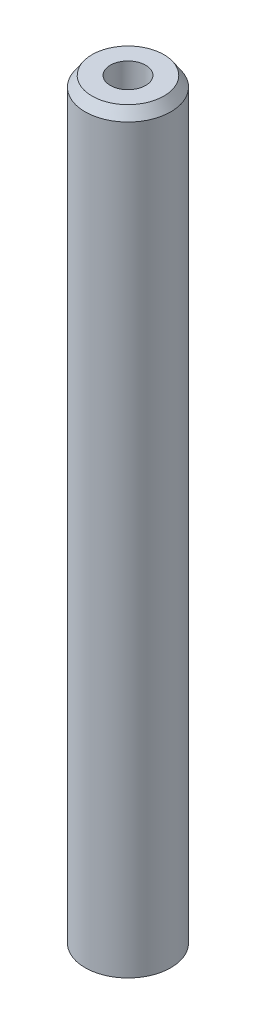
ISO-10303-21;
HEADER;
FILE_DESCRIPTION(('STEP AP214'),'2;1');
FILE_NAME('part.step','',(''),(''),'','','');
FILE_SCHEMA(('AUTOMOTIVE_DESIGN { 1 0 10303 214 1 1 1 1 }'));
ENDSEC;
DATA;
#1=APPLICATION_CONTEXT('core data for automotive mechanical design processes');
#2=APPLICATION_PROTOCOL_DEFINITION('international standard','automotive_design',2000,#1);
#3=PRODUCT_CONTEXT('',#1,'mechanical');
#4=PRODUCT('Part','Part','',(#3));
#5=PRODUCT_RELATED_PRODUCT_CATEGORY('part','',(#4));
#6=PRODUCT_DEFINITION_FORMATION('','',#4);
#7=PRODUCT_DEFINITION_CONTEXT('part definition',#1,'design');
#8=PRODUCT_DEFINITION('design','',#6,#7);
#9=PRODUCT_DEFINITION_SHAPE('','',#8);
#10=(LENGTH_UNIT() NAMED_UNIT(*) SI_UNIT(.MILLI.,.METRE.));
#11=(NAMED_UNIT(*) PLANE_ANGLE_UNIT() SI_UNIT($,.RADIAN.));
#12=(NAMED_UNIT(*) SI_UNIT($,.STERADIAN.) SOLID_ANGLE_UNIT());
#13=UNCERTAINTY_MEASURE_WITH_UNIT(LENGTH_MEASURE(1.E-05),#10,'distance_accuracy_value','');
#14=(GEOMETRIC_REPRESENTATION_CONTEXT(3) GLOBAL_UNCERTAINTY_ASSIGNED_CONTEXT((#13)) GLOBAL_UNIT_ASSIGNED_CONTEXT((#10,
#11,#12)) REPRESENTATION_CONTEXT('',''));
#15=CARTESIAN_POINT('',(0.,0.,0.));
#16=DIRECTION('',(0.,0.,1.));
#17=DIRECTION('',(1.,0.,0.));
#18=AXIS2_PLACEMENT_3D('',#15,#16,#17);
#19=CARTESIAN_POINT('',(0.,88.4882453535549,0.));
#20=DIRECTION('',(0.,-1.,0.));
#21=DIRECTION('',(0.,0.,-1.));
#22=AXIS2_PLACEMENT_3D('',#19,#20,#21);
#23=CYLINDRICAL_SURFACE('',#22,5.);
#24=CARTESIAN_POINT('',(0.,87.300290587962,0.));
#25=DIRECTION('',(0.,1.,0.));
#26=DIRECTION('',(0.,0.,1.));
#27=AXIS2_PLACEMENT_3D('',#24,#25,#26);
#28=CIRCLE('',#27,5.);
#29=CARTESIAN_POINT('',(0.,87.300290587962,5.));
#30=VERTEX_POINT('',#29);
#31=EDGE_CURVE('E50',#30,#30,#28,.F.);
#32=ORIENTED_EDGE('',*,*,#31,.T.);
#33=EDGE_LOOP('',(#32));
#34=FACE_BOUND('',#33,.T.);
#35=CARTESIAN_POINT('',(0.,0.807887738359103,0.));
#36=DIRECTION('',(0.,1.,0.));
#37=DIRECTION('',(0.,0.,1.));
#38=AXIS2_PLACEMENT_3D('',#35,#36,#37);
#39=CIRCLE('',#38,5.);
#40=CARTESIAN_POINT('',(0.,0.807887738359103,5.));
#41=VERTEX_POINT('',#40);
#42=EDGE_CURVE('E51',#41,#41,#39,.T.);
#43=ORIENTED_EDGE('',*,*,#42,.T.);
#44=EDGE_LOOP('',(#43));
#45=FACE_BOUND('',#44,.T.);
#46=ADVANCED_FACE('F39',(#34,#45),#23,.T.);
#47=CARTESIAN_POINT('',(0.,88.4882453535549,0.));
#48=DIRECTION('',(0.,1.,0.));
#49=DIRECTION('',(0.,0.,1.));
#50=AXIS2_PLACEMENT_3D('',#47,#48,#49);
#51=PLANE('',#50);
#52=CARTESIAN_POINT('',(0.,88.4882453535549,0.));
#53=DIRECTION('',(0.,1.,0.));
#54=DIRECTION('',(0.,0.,1.));
#55=AXIS2_PLACEMENT_3D('',#52,#53,#54);
#56=CIRCLE('',#55,4.19211226164089);
#57=CARTESIAN_POINT('',(0.,88.4882453535549,4.19211226164089));
#58=VERTEX_POINT('',#57);
#59=EDGE_CURVE('E54',#58,#58,#56,.T.);
#60=ORIENTED_EDGE('',*,*,#59,.T.);
#61=EDGE_LOOP('',(#60));
#62=FACE_BOUND('',#61,.T.);
#63=CARTESIAN_POINT('',(0.,88.4882453535549,0.));
#64=DIRECTION('',(0.,1.,0.));
#65=DIRECTION('',(0.,0.,1.));
#66=AXIS2_PLACEMENT_3D('',#63,#64,#65);
#67=CIRCLE('',#66,2.05859989531301);
#68=CARTESIAN_POINT('',(0.,88.4882453535549,2.05859989531301));
#69=VERTEX_POINT('',#68);
#70=EDGE_CURVE('E58',#69,#69,#67,.T.);
#71=ORIENTED_EDGE('',*,*,#70,.F.);
#72=EDGE_LOOP('',(#71));
#73=FACE_BOUND('',#72,.T.);
#74=ADVANCED_FACE('F69',(#62,#73),#51,.T.);
#75=CARTESIAN_POINT('',(0.,0.,0.));
#76=DIRECTION('',(0.,1.,0.));
#77=DIRECTION('',(0.,0.,1.));
#78=AXIS2_PLACEMENT_3D('',#75,#76,#77);
#79=PLANE('',#78);
#80=CARTESIAN_POINT('',(0.,0.,0.));
#81=DIRECTION('',(0.,1.,0.));
#82=DIRECTION('',(0.,0.,1.));
#83=AXIS2_PLACEMENT_3D('',#80,#81,#82);
#84=CIRCLE('',#83,3.81204523440712);
#85=CARTESIAN_POINT('',(0.,0.,3.81204523440712));
#86=VERTEX_POINT('',#85);
#87=EDGE_CURVE('E10',#86,#86,#84,.F.);
#88=ORIENTED_EDGE('',*,*,#87,.T.);
#89=EDGE_LOOP('',(#88));
#90=FACE_BOUND('',#89,.T.);
#91=CARTESIAN_POINT('',(0.,0.,0.));
#92=DIRECTION('',(0.,1.,0.));
#93=DIRECTION('',(0.,0.,1.));
#94=AXIS2_PLACEMENT_3D('',#91,#92,#93);
#95=CIRCLE('',#94,2.05859989531301);
#96=CARTESIAN_POINT('',(0.,0.,2.05859989531301));
#97=VERTEX_POINT('',#96);
#98=EDGE_CURVE('E63',#97,#97,#95,.T.);
#99=ORIENTED_EDGE('',*,*,#98,.T.);
#100=EDGE_LOOP('',(#99));
#101=FACE_BOUND('',#100,.T.);
#102=ADVANCED_FACE('F75',(#90,#101),#79,.F.);
#103=CARTESIAN_POINT('',(0.,88.4882453535549,0.));
#104=DIRECTION('',(0.,-1.,0.));
#105=DIRECTION('',(0.,0.,-1.));
#106=AXIS2_PLACEMENT_3D('',#103,#104,#105);
#107=CYLINDRICAL_SURFACE('',#106,2.05859989531301);
#108=ORIENTED_EDGE('',*,*,#70,.T.);
#109=EDGE_LOOP('',(#108));
#110=FACE_BOUND('',#109,.T.);
#111=ORIENTED_EDGE('',*,*,#98,.F.);
#112=EDGE_LOOP('',(#111));
#113=FACE_BOUND('',#112,.T.);
#114=ADVANCED_FACE('F70',(#110,#113),#107,.F.);
#115=CARTESIAN_POINT('',(0.,88.4882453535549,0.));
#116=DIRECTION('',(0.,-1.,0.));
#117=DIRECTION('',(0.,0.,-1.));
#118=AXIS2_PLACEMENT_3D('',#115,#116,#117);
#119=CONICAL_SURFACE('',#118,4.19211226164089,0.597221841378965);
#120=ORIENTED_EDGE('',*,*,#31,.F.);
#121=EDGE_LOOP('',(#120));
#122=FACE_BOUND('',#121,.T.);
#123=ORIENTED_EDGE('',*,*,#59,.F.);
#124=EDGE_LOOP('',(#123));
#125=FACE_BOUND('',#124,.T.);
#126=ADVANCED_FACE('F81',(#122,#125),#119,.T.);
#127=CARTESIAN_POINT('',(0.,0.807887738359103,0.));
#128=DIRECTION('',(0.,1.,0.));
#129=DIRECTION('',(0.,0.,1.));
#130=AXIS2_PLACEMENT_3D('',#127,#128,#129);
#131=CONICAL_SURFACE('',#130,5.,0.973574485415931);
#132=ORIENTED_EDGE('',*,*,#87,.F.);
#133=EDGE_LOOP('',(#132));
#134=FACE_BOUND('',#133,.T.);
#135=ORIENTED_EDGE('',*,*,#42,.F.);
#136=EDGE_LOOP('',(#135));
#137=FACE_BOUND('',#136,.T.);
#138=ADVANCED_FACE('F45',(#134,#137),#131,.T.);
#139=CLOSED_SHELL('',(#46,#74,#102,#114,#126,#138));
#140=MANIFOLD_SOLID_BREP('B2',#139);
#141=ADVANCED_BREP_SHAPE_REPRESENTATION('',(#18,#140),#14);
#142=SHAPE_DEFINITION_REPRESENTATION(#9,#141);
ENDSEC;
END-ISO-10303-21;
